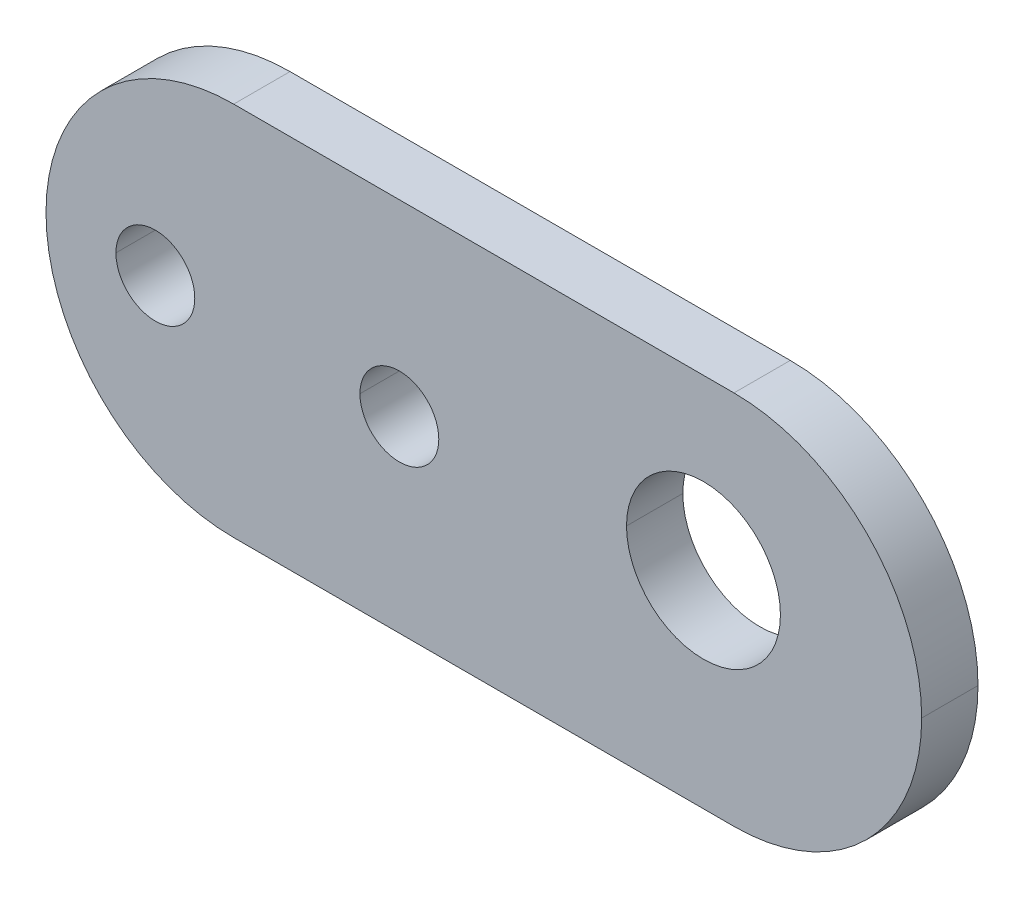
ISO-10303-21;
HEADER;
FILE_DESCRIPTION(('STEP AP214'),'2;1');
FILE_NAME('part.step','',(''),(''),'','','');
FILE_SCHEMA(('AUTOMOTIVE_DESIGN { 1 0 10303 214 1 1 1 1 }'));
ENDSEC;
DATA;
#1=APPLICATION_CONTEXT('core data for automotive mechanical design processes');
#2=APPLICATION_PROTOCOL_DEFINITION('international standard','automotive_design',2000,#1);
#3=PRODUCT_CONTEXT('',#1,'mechanical');
#4=PRODUCT('Part','Part','',(#3));
#5=PRODUCT_RELATED_PRODUCT_CATEGORY('part','',(#4));
#6=PRODUCT_DEFINITION_FORMATION('','',#4);
#7=PRODUCT_DEFINITION_CONTEXT('part definition',#1,'design');
#8=PRODUCT_DEFINITION('design','',#6,#7);
#9=PRODUCT_DEFINITION_SHAPE('','',#8);
#10=(LENGTH_UNIT() NAMED_UNIT(*) SI_UNIT(.MILLI.,.METRE.));
#11=(NAMED_UNIT(*) PLANE_ANGLE_UNIT() SI_UNIT($,.RADIAN.));
#12=(NAMED_UNIT(*) SI_UNIT($,.STERADIAN.) SOLID_ANGLE_UNIT());
#13=UNCERTAINTY_MEASURE_WITH_UNIT(LENGTH_MEASURE(1.E-05),#10,'distance_accuracy_value','');
#14=(GEOMETRIC_REPRESENTATION_CONTEXT(3) GLOBAL_UNCERTAINTY_ASSIGNED_CONTEXT((#13)) GLOBAL_UNIT_ASSIGNED_CONTEXT((#10,
#11,#12)) REPRESENTATION_CONTEXT('',''));
#15=CARTESIAN_POINT('',(0.,0.,0.));
#16=DIRECTION('',(0.,0.,1.));
#17=DIRECTION('',(1.,0.,0.));
#18=AXIS2_PLACEMENT_3D('',#15,#16,#17);
#19=CARTESIAN_POINT('',(-13.325,0.,-3.));
#20=DIRECTION('',(0.,0.,1.));
#21=DIRECTION('',(1.,0.,0.));
#22=AXIS2_PLACEMENT_3D('',#19,#20,#21);
#23=CYLINDRICAL_SURFACE('',#22,10.);
#24=CARTESIAN_POINT('',(-13.325,0.,-3.));
#25=DIRECTION('',(0.,0.,-1.));
#26=DIRECTION('',(-1.,0.,0.));
#27=AXIS2_PLACEMENT_3D('',#24,#25,#26);
#28=CIRCLE('',#27,10.);
#29=CARTESIAN_POINT('',(-13.325,-10.,-3.));
#30=VERTEX_POINT('',#29);
#31=CARTESIAN_POINT('',(-23.325,0.,-3.));
#32=VERTEX_POINT('',#31);
#33=EDGE_CURVE('E197',#30,#32,#28,.T.);
#34=ORIENTED_EDGE('',*,*,#33,.F.);
#35=DIRECTION('',(0.,0.,-1.));
#36=VECTOR('',#35,1.);
#37=CARTESIAN_POINT('',(-13.325,-10.,-3.));
#38=LINE('',#37,#36);
#39=CARTESIAN_POINT('',(-13.325,-10.,0.));
#40=VERTEX_POINT('',#39);
#41=EDGE_CURVE('E202',#40,#30,#38,.T.);
#42=ORIENTED_EDGE('',*,*,#41,.F.);
#43=CARTESIAN_POINT('',(-13.325,0.,0.));
#44=DIRECTION('',(0.,0.,1.));
#45=DIRECTION('',(-1.,0.,0.));
#46=AXIS2_PLACEMENT_3D('',#43,#44,#45);
#47=CIRCLE('',#46,10.);
#48=CARTESIAN_POINT('',(-23.325,0.,0.));
#49=VERTEX_POINT('',#48);
#50=EDGE_CURVE('E256',#49,#40,#47,.T.);
#51=ORIENTED_EDGE('',*,*,#50,.F.);
#52=DIRECTION('',(0.,0.,-1.));
#53=VECTOR('',#52,1.);
#54=CARTESIAN_POINT('',(-23.325,0.,-3.));
#55=LINE('',#54,#53);
#56=EDGE_CURVE('E11',#49,#32,#55,.T.);
#57=ORIENTED_EDGE('',*,*,#56,.T.);
#58=EDGE_LOOP('',(#34,#42,#51,#57));
#59=FACE_BOUND('',#58,.T.);
#60=ADVANCED_FACE('F17',(#59),#23,.T.);
#61=CARTESIAN_POINT('',(-13.325,0.,-3.));
#62=DIRECTION('',(0.,0.,1.));
#63=DIRECTION('',(1.,0.,0.));
#64=AXIS2_PLACEMENT_3D('',#61,#62,#63);
#65=CYLINDRICAL_SURFACE('',#64,10.);
#66=DIRECTION('',(0.,0.,1.));
#67=VECTOR('',#66,1.);
#68=CARTESIAN_POINT('',(-13.325,10.,-3.));
#69=LINE('',#68,#67);
#70=CARTESIAN_POINT('',(-13.325,10.,-3.));
#71=VERTEX_POINT('',#70);
#72=CARTESIAN_POINT('',(-13.325,10.,0.));
#73=VERTEX_POINT('',#72);
#74=EDGE_CURVE('E181',#71,#73,#69,.T.);
#75=ORIENTED_EDGE('',*,*,#74,.F.);
#76=CARTESIAN_POINT('',(-13.325,0.,-3.));
#77=DIRECTION('',(0.,0.,-1.));
#78=DIRECTION('',(-1.,0.,0.));
#79=AXIS2_PLACEMENT_3D('',#76,#77,#78);
#80=CIRCLE('',#79,10.);
#81=EDGE_CURVE('E201',#32,#71,#80,.T.);
#82=ORIENTED_EDGE('',*,*,#81,.F.);
#83=ORIENTED_EDGE('',*,*,#56,.F.);
#84=CARTESIAN_POINT('',(-13.325,0.,0.));
#85=DIRECTION('',(0.,0.,1.));
#86=DIRECTION('',(-1.,0.,0.));
#87=AXIS2_PLACEMENT_3D('',#84,#85,#86);
#88=CIRCLE('',#87,10.);
#89=EDGE_CURVE('E252',#73,#49,#88,.T.);
#90=ORIENTED_EDGE('',*,*,#89,.F.);
#91=EDGE_LOOP('',(#75,#82,#83,#90));
#92=FACE_BOUND('',#91,.T.);
#93=ADVANCED_FACE('F19',(#92),#65,.T.);
#94=CARTESIAN_POINT('',(13.325,0.,-3.));
#95=DIRECTION('',(0.,0.,1.));
#96=DIRECTION('',(1.,0.,0.));
#97=AXIS2_PLACEMENT_3D('',#94,#95,#96);
#98=CYLINDRICAL_SURFACE('',#97,10.);
#99=CARTESIAN_POINT('',(13.325,0.,-3.));
#100=DIRECTION('',(0.,0.,-1.));
#101=DIRECTION('',(-1.,0.,0.));
#102=AXIS2_PLACEMENT_3D('',#99,#100,#101);
#103=CIRCLE('',#102,10.);
#104=CARTESIAN_POINT('',(23.325,0.,-3.));
#105=VERTEX_POINT('',#104);
#106=CARTESIAN_POINT('',(13.325,-10.,-3.));
#107=VERTEX_POINT('',#106);
#108=EDGE_CURVE('E241',#105,#107,#103,.T.);
#109=ORIENTED_EDGE('',*,*,#108,.F.);
#110=DIRECTION('',(0.,0.,1.));
#111=VECTOR('',#110,1.);
#112=CARTESIAN_POINT('',(23.325,0.,-3.));
#113=LINE('',#112,#111);
#114=CARTESIAN_POINT('',(23.325,0.,0.));
#115=VERTEX_POINT('',#114);
#116=EDGE_CURVE('E26',#105,#115,#113,.T.);
#117=ORIENTED_EDGE('',*,*,#116,.T.);
#118=CARTESIAN_POINT('',(13.325,0.,0.));
#119=DIRECTION('',(0.,0.,1.));
#120=DIRECTION('',(-1.,0.,0.));
#121=AXIS2_PLACEMENT_3D('',#118,#119,#120);
#122=CIRCLE('',#121,10.);
#123=CARTESIAN_POINT('',(13.325,-10.,0.));
#124=VERTEX_POINT('',#123);
#125=EDGE_CURVE('E259',#124,#115,#122,.T.);
#126=ORIENTED_EDGE('',*,*,#125,.F.);
#127=DIRECTION('',(0.,0.,1.));
#128=VECTOR('',#127,1.);
#129=CARTESIAN_POINT('',(13.325,-10.,-3.));
#130=LINE('',#129,#128);
#131=EDGE_CURVE('E224',#107,#124,#130,.T.);
#132=ORIENTED_EDGE('',*,*,#131,.F.);
#133=EDGE_LOOP('',(#109,#117,#126,#132));
#134=FACE_BOUND('',#133,.T.);
#135=ADVANCED_FACE('F441',(#134),#98,.T.);
#136=CARTESIAN_POINT('',(13.325,0.,-3.));
#137=DIRECTION('',(0.,0.,1.));
#138=DIRECTION('',(1.,0.,0.));
#139=AXIS2_PLACEMENT_3D('',#136,#137,#138);
#140=CYLINDRICAL_SURFACE('',#139,10.);
#141=ORIENTED_EDGE('',*,*,#116,.F.);
#142=CARTESIAN_POINT('',(13.325,0.,-3.));
#143=DIRECTION('',(0.,0.,-1.));
#144=DIRECTION('',(-1.,0.,0.));
#145=AXIS2_PLACEMENT_3D('',#142,#143,#144);
#146=CIRCLE('',#145,10.);
#147=CARTESIAN_POINT('',(13.325,10.,-3.));
#148=VERTEX_POINT('',#147);
#149=EDGE_CURVE('E237',#148,#105,#146,.T.);
#150=ORIENTED_EDGE('',*,*,#149,.F.);
#151=DIRECTION('',(0.,0.,-1.));
#152=VECTOR('',#151,1.);
#153=CARTESIAN_POINT('',(13.325,10.,-3.));
#154=LINE('',#153,#152);
#155=CARTESIAN_POINT('',(13.325,10.,0.));
#156=VERTEX_POINT('',#155);
#157=EDGE_CURVE('E216',#156,#148,#154,.T.);
#158=ORIENTED_EDGE('',*,*,#157,.F.);
#159=CARTESIAN_POINT('',(13.325,0.,0.));
#160=DIRECTION('',(0.,0.,1.));
#161=DIRECTION('',(-1.,0.,0.));
#162=AXIS2_PLACEMENT_3D('',#159,#160,#161);
#163=CIRCLE('',#162,10.);
#164=EDGE_CURVE('E209',#115,#156,#163,.T.);
#165=ORIENTED_EDGE('',*,*,#164,.F.);
#166=EDGE_LOOP('',(#141,#150,#158,#165));
#167=FACE_BOUND('',#166,.T.);
#168=ADVANCED_FACE('F443',(#167),#140,.T.);
#169=CARTESIAN_POINT('',(11.7,1.,-3.));
#170=DIRECTION('',(0.,0.,1.));
#171=DIRECTION('',(1.,0.,0.));
#172=AXIS2_PLACEMENT_3D('',#169,#170,#171);
#173=CYLINDRICAL_SURFACE('',#172,4.1);
#174=DIRECTION('',(0.,0.,1.));
#175=VECTOR('',#174,1.);
#176=CARTESIAN_POINT('',(7.6,1.,-3.));
#177=LINE('',#176,#175);
#178=CARTESIAN_POINT('',(7.6,1.,-3.));
#179=VERTEX_POINT('',#178);
#180=CARTESIAN_POINT('',(7.6,1.,0.));
#181=VERTEX_POINT('',#180);
#182=EDGE_CURVE('E170',#179,#181,#177,.T.);
#183=ORIENTED_EDGE('',*,*,#182,.F.);
#184=CARTESIAN_POINT('',(11.7,1.,-3.));
#185=DIRECTION('',(0.,0.,1.));
#186=DIRECTION('',(1.,0.,0.));
#187=AXIS2_PLACEMENT_3D('',#184,#185,#186);
#188=CIRCLE('',#187,4.1);
#189=CARTESIAN_POINT('',(15.8,1.,-3.));
#190=VERTEX_POINT('',#189);
#191=EDGE_CURVE('E244',#190,#179,#188,.T.);
#192=ORIENTED_EDGE('',*,*,#191,.F.);
#193=DIRECTION('',(0.,0.,1.));
#194=VECTOR('',#193,1.);
#195=CARTESIAN_POINT('',(15.8,1.,-3.));
#196=LINE('',#195,#194);
#197=CARTESIAN_POINT('',(15.8,1.,0.));
#198=VERTEX_POINT('',#197);
#199=EDGE_CURVE('E175',#190,#198,#196,.T.);
#200=ORIENTED_EDGE('',*,*,#199,.T.);
#201=CARTESIAN_POINT('',(11.7,1.,0.));
#202=DIRECTION('',(0.,0.,1.));
#203=DIRECTION('',(1.,0.,0.));
#204=AXIS2_PLACEMENT_3D('',#201,#202,#203);
#205=CIRCLE('',#204,4.1);
#206=EDGE_CURVE('E206',#198,#181,#205,.T.);
#207=ORIENTED_EDGE('',*,*,#206,.T.);
#208=EDGE_LOOP('',(#183,#192,#200,#207));
#209=FACE_BOUND('',#208,.T.);
#210=ADVANCED_FACE('F423',(#209),#173,.F.);
#211=CARTESIAN_POINT('',(-4.5,0.,-3.));
#212=DIRECTION('',(0.,0.,1.));
#213=DIRECTION('',(1.,0.,0.));
#214=AXIS2_PLACEMENT_3D('',#211,#212,#213);
#215=CYLINDRICAL_SURFACE('',#214,2.1);
#216=DIRECTION('',(0.,0.,1.));
#217=VECTOR('',#216,1.);
#218=CARTESIAN_POINT('',(-6.6,0.,-3.));
#219=LINE('',#218,#217);
#220=CARTESIAN_POINT('',(-6.6,0.,-3.));
#221=VERTEX_POINT('',#220);
#222=CARTESIAN_POINT('',(-6.6,0.,0.));
#223=VERTEX_POINT('',#222);
#224=EDGE_CURVE('E189',#221,#223,#219,.T.);
#225=ORIENTED_EDGE('',*,*,#224,.F.);
#226=CARTESIAN_POINT('',(-4.5,0.,-3.));
#227=DIRECTION('',(0.,0.,1.));
#228=DIRECTION('',(1.,0.,0.));
#229=AXIS2_PLACEMENT_3D('',#226,#227,#228);
#230=CIRCLE('',#229,2.1);
#231=CARTESIAN_POINT('',(-2.4,0.,-3.));
#232=VERTEX_POINT('',#231);
#233=EDGE_CURVE('E247',#232,#221,#230,.T.);
#234=ORIENTED_EDGE('',*,*,#233,.F.);
#235=DIRECTION('',(0.,0.,1.));
#236=VECTOR('',#235,1.);
#237=CARTESIAN_POINT('',(-2.4,0.,-3.));
#238=LINE('',#237,#236);
#239=CARTESIAN_POINT('',(-2.4,0.,0.));
#240=VERTEX_POINT('',#239);
#241=EDGE_CURVE('E205',#232,#240,#238,.T.);
#242=ORIENTED_EDGE('',*,*,#241,.T.);
#243=CARTESIAN_POINT('',(-4.5,0.,0.));
#244=DIRECTION('',(0.,0.,1.));
#245=DIRECTION('',(1.,0.,0.));
#246=AXIS2_PLACEMENT_3D('',#243,#244,#245);
#247=CIRCLE('',#246,2.1);
#248=EDGE_CURVE('E146',#240,#223,#247,.T.);
#249=ORIENTED_EDGE('',*,*,#248,.T.);
#250=EDGE_LOOP('',(#225,#234,#242,#249));
#251=FACE_BOUND('',#250,.T.);
#252=ADVANCED_FACE('F459',(#251),#215,.F.);
#253=CARTESIAN_POINT('',(-17.5,0.,-3.));
#254=DIRECTION('',(0.,0.,1.));
#255=DIRECTION('',(1.,0.,0.));
#256=AXIS2_PLACEMENT_3D('',#253,#254,#255);
#257=CYLINDRICAL_SURFACE('',#256,2.1);
#258=DIRECTION('',(0.,0.,1.));
#259=VECTOR('',#258,1.);
#260=CARTESIAN_POINT('',(-19.6,0.,-3.));
#261=LINE('',#260,#259);
#262=CARTESIAN_POINT('',(-19.6,0.,-3.));
#263=VERTEX_POINT('',#262);
#264=CARTESIAN_POINT('',(-19.6,0.,0.));
#265=VERTEX_POINT('',#264);
#266=EDGE_CURVE('E159',#263,#265,#261,.T.);
#267=ORIENTED_EDGE('',*,*,#266,.F.);
#268=CARTESIAN_POINT('',(-17.5,0.,-3.));
#269=DIRECTION('',(0.,0.,1.));
#270=DIRECTION('',(1.,0.,0.));
#271=AXIS2_PLACEMENT_3D('',#268,#269,#270);
#272=CIRCLE('',#271,2.1);
#273=CARTESIAN_POINT('',(-15.4,0.,-3.));
#274=VERTEX_POINT('',#273);
#275=EDGE_CURVE('E151',#274,#263,#272,.T.);
#276=ORIENTED_EDGE('',*,*,#275,.F.);
#277=DIRECTION('',(0.,0.,1.));
#278=VECTOR('',#277,1.);
#279=CARTESIAN_POINT('',(-15.4,0.,-3.));
#280=LINE('',#279,#278);
#281=CARTESIAN_POINT('',(-15.4,0.,0.));
#282=VERTEX_POINT('',#281);
#283=EDGE_CURVE('E149',#274,#282,#280,.T.);
#284=ORIENTED_EDGE('',*,*,#283,.T.);
#285=CARTESIAN_POINT('',(-17.5,0.,0.));
#286=DIRECTION('',(0.,0.,1.));
#287=DIRECTION('',(1.,0.,0.));
#288=AXIS2_PLACEMENT_3D('',#285,#286,#287);
#289=CIRCLE('',#288,2.1);
#290=EDGE_CURVE('E136',#282,#265,#289,.T.);
#291=ORIENTED_EDGE('',*,*,#290,.T.);
#292=EDGE_LOOP('',(#267,#276,#284,#291));
#293=FACE_BOUND('',#292,.T.);
#294=ADVANCED_FACE('F150',(#293),#257,.F.);
#295=CARTESIAN_POINT('',(0.,0.,0.));
#296=DIRECTION('',(0.,0.,-1.));
#297=DIRECTION('',(0.,-1.,0.));
#298=AXIS2_PLACEMENT_3D('',#295,#296,#297);
#299=PLANE('',#298);
#300=ORIENTED_EDGE('',*,*,#290,.F.);
#301=CARTESIAN_POINT('',(-17.5,0.,0.));
#302=DIRECTION('',(0.,0.,1.));
#303=DIRECTION('',(1.,0.,0.));
#304=AXIS2_PLACEMENT_3D('',#301,#302,#303);
#305=CIRCLE('',#304,2.1);
#306=EDGE_CURVE('E141',#265,#282,#305,.T.);
#307=ORIENTED_EDGE('',*,*,#306,.F.);
#308=EDGE_LOOP('',(#300,#307));
#309=FACE_BOUND('',#308,.T.);
#310=ORIENTED_EDGE('',*,*,#248,.F.);
#311=CARTESIAN_POINT('',(-4.5,0.,0.));
#312=DIRECTION('',(0.,0.,1.));
#313=DIRECTION('',(1.,0.,0.));
#314=AXIS2_PLACEMENT_3D('',#311,#312,#313);
#315=CIRCLE('',#314,2.1);
#316=EDGE_CURVE('E193',#223,#240,#315,.T.);
#317=ORIENTED_EDGE('',*,*,#316,.F.);
#318=EDGE_LOOP('',(#310,#317));
#319=FACE_BOUND('',#318,.T.);
#320=ORIENTED_EDGE('',*,*,#206,.F.);
#321=CARTESIAN_POINT('',(11.7,1.,0.));
#322=DIRECTION('',(0.,0.,1.));
#323=DIRECTION('',(1.,0.,0.));
#324=AXIS2_PLACEMENT_3D('',#321,#322,#323);
#325=CIRCLE('',#324,4.1);
#326=EDGE_CURVE('E172',#181,#198,#325,.T.);
#327=ORIENTED_EDGE('',*,*,#326,.F.);
#328=EDGE_LOOP('',(#320,#327));
#329=FACE_BOUND('',#328,.T.);
#330=ORIENTED_EDGE('',*,*,#89,.T.);
#331=ORIENTED_EDGE('',*,*,#50,.T.);
#332=DIRECTION('',(1.,0.,0.));
#333=VECTOR('',#332,1.);
#334=CARTESIAN_POINT('',(23.325,-10.,0.));
#335=LINE('',#334,#333);
#336=EDGE_CURVE('E228',#40,#124,#335,.T.);
#337=ORIENTED_EDGE('',*,*,#336,.T.);
#338=ORIENTED_EDGE('',*,*,#125,.T.);
#339=ORIENTED_EDGE('',*,*,#164,.T.);
#340=DIRECTION('',(-1.,0.,0.));
#341=VECTOR('',#340,1.);
#342=CARTESIAN_POINT('',(23.325,10.,0.));
#343=LINE('',#342,#341);
#344=EDGE_CURVE('E185',#156,#73,#343,.T.);
#345=ORIENTED_EDGE('',*,*,#344,.T.);
#346=EDGE_LOOP('',(#330,#331,#337,#338,#339,#345));
#347=FACE_BOUND('',#346,.T.);
#348=ADVANCED_FACE('F138',(#309,#319,#329,#347),#299,.F.);
#349=CARTESIAN_POINT('',(0.,0.,-3.));
#350=DIRECTION('',(0.,0.,-1.));
#351=DIRECTION('',(0.,-1.,0.));
#352=AXIS2_PLACEMENT_3D('',#349,#350,#351);
#353=PLANE('',#352);
#354=ORIENTED_EDGE('',*,*,#275,.T.);
#355=CARTESIAN_POINT('',(-17.5,0.,-3.));
#356=DIRECTION('',(0.,0.,1.));
#357=DIRECTION('',(1.,0.,0.));
#358=AXIS2_PLACEMENT_3D('',#355,#356,#357);
#359=CIRCLE('',#358,2.1);
#360=EDGE_CURVE('E166',#263,#274,#359,.T.);
#361=ORIENTED_EDGE('',*,*,#360,.T.);
#362=EDGE_LOOP('',(#354,#361));
#363=FACE_BOUND('',#362,.T.);
#364=ORIENTED_EDGE('',*,*,#233,.T.);
#365=CARTESIAN_POINT('',(-4.5,0.,-3.));
#366=DIRECTION('',(0.,0.,1.));
#367=DIRECTION('',(1.,0.,0.));
#368=AXIS2_PLACEMENT_3D('',#365,#366,#367);
#369=CIRCLE('',#368,2.1);
#370=EDGE_CURVE('E180',#221,#232,#369,.T.);
#371=ORIENTED_EDGE('',*,*,#370,.T.);
#372=EDGE_LOOP('',(#364,#371));
#373=FACE_BOUND('',#372,.T.);
#374=ORIENTED_EDGE('',*,*,#191,.T.);
#375=CARTESIAN_POINT('',(11.7,1.,-3.));
#376=DIRECTION('',(0.,0.,1.));
#377=DIRECTION('',(1.,0.,0.));
#378=AXIS2_PLACEMENT_3D('',#375,#376,#377);
#379=CIRCLE('',#378,4.1);
#380=EDGE_CURVE('E395',#179,#190,#379,.T.);
#381=ORIENTED_EDGE('',*,*,#380,.T.);
#382=EDGE_LOOP('',(#374,#381));
#383=FACE_BOUND('',#382,.T.);
#384=DIRECTION('',(1.,0.,0.));
#385=VECTOR('',#384,1.);
#386=CARTESIAN_POINT('',(23.325,-10.,-3.));
#387=LINE('',#386,#385);
#388=EDGE_CURVE('E220',#30,#107,#387,.T.);
#389=ORIENTED_EDGE('',*,*,#388,.F.);
#390=ORIENTED_EDGE('',*,*,#33,.T.);
#391=ORIENTED_EDGE('',*,*,#81,.T.);
#392=DIRECTION('',(-1.,0.,0.));
#393=VECTOR('',#392,1.);
#394=CARTESIAN_POINT('',(23.325,10.,-3.));
#395=LINE('',#394,#393);
#396=EDGE_CURVE('E156',#148,#71,#395,.T.);
#397=ORIENTED_EDGE('',*,*,#396,.F.);
#398=ORIENTED_EDGE('',*,*,#149,.T.);
#399=ORIENTED_EDGE('',*,*,#108,.T.);
#400=EDGE_LOOP('',(#389,#390,#391,#397,#398,#399));
#401=FACE_BOUND('',#400,.T.);
#402=ADVANCED_FACE('F415',(#363,#373,#383,#401),#353,.T.);
#403=CARTESIAN_POINT('',(23.325,-10.,-3.));
#404=DIRECTION('',(0.,-1.,0.));
#405=DIRECTION('',(0.,0.,-1.));
#406=AXIS2_PLACEMENT_3D('',#403,#404,#405);
#407=PLANE('',#406);
#408=ORIENTED_EDGE('',*,*,#388,.T.);
#409=ORIENTED_EDGE('',*,*,#131,.T.);
#410=ORIENTED_EDGE('',*,*,#336,.F.);
#411=ORIENTED_EDGE('',*,*,#41,.T.);
#412=EDGE_LOOP('',(#408,#409,#410,#411));
#413=FACE_BOUND('',#412,.T.);
#414=ADVANCED_FACE('F439',(#413),#407,.T.);
#415=CARTESIAN_POINT('',(23.325,10.,-3.));
#416=DIRECTION('',(0.,1.,0.));
#417=DIRECTION('',(1.,0.,0.));
#418=AXIS2_PLACEMENT_3D('',#415,#416,#417);
#419=PLANE('',#418);
#420=ORIENTED_EDGE('',*,*,#396,.T.);
#421=ORIENTED_EDGE('',*,*,#74,.T.);
#422=ORIENTED_EDGE('',*,*,#344,.F.);
#423=ORIENTED_EDGE('',*,*,#157,.T.);
#424=EDGE_LOOP('',(#420,#421,#422,#423));
#425=FACE_BOUND('',#424,.T.);
#426=ADVANCED_FACE('F433',(#425),#419,.T.);
#427=CARTESIAN_POINT('',(-17.5,0.,-3.));
#428=DIRECTION('',(0.,0.,1.));
#429=DIRECTION('',(1.,0.,0.));
#430=AXIS2_PLACEMENT_3D('',#427,#428,#429);
#431=CYLINDRICAL_SURFACE('',#430,2.1);
#432=ORIENTED_EDGE('',*,*,#360,.F.);
#433=ORIENTED_EDGE('',*,*,#266,.T.);
#434=ORIENTED_EDGE('',*,*,#306,.T.);
#435=ORIENTED_EDGE('',*,*,#283,.F.);
#436=EDGE_LOOP('',(#432,#433,#434,#435));
#437=FACE_BOUND('',#436,.T.);
#438=ADVANCED_FACE('F158',(#437),#431,.F.);
#439=CARTESIAN_POINT('',(-4.5,0.,-3.));
#440=DIRECTION('',(0.,0.,1.));
#441=DIRECTION('',(1.,0.,0.));
#442=AXIS2_PLACEMENT_3D('',#439,#440,#441);
#443=CYLINDRICAL_SURFACE('',#442,2.1);
#444=ORIENTED_EDGE('',*,*,#370,.F.);
#445=ORIENTED_EDGE('',*,*,#224,.T.);
#446=ORIENTED_EDGE('',*,*,#316,.T.);
#447=ORIENTED_EDGE('',*,*,#241,.F.);
#448=EDGE_LOOP('',(#444,#445,#446,#447));
#449=FACE_BOUND('',#448,.T.);
#450=ADVANCED_FACE('F465',(#449),#443,.F.);
#451=CARTESIAN_POINT('',(11.7,1.,-3.));
#452=DIRECTION('',(0.,0.,1.));
#453=DIRECTION('',(1.,0.,0.));
#454=AXIS2_PLACEMENT_3D('',#451,#452,#453);
#455=CYLINDRICAL_SURFACE('',#454,4.1);
#456=ORIENTED_EDGE('',*,*,#380,.F.);
#457=ORIENTED_EDGE('',*,*,#182,.T.);
#458=ORIENTED_EDGE('',*,*,#326,.T.);
#459=ORIENTED_EDGE('',*,*,#199,.F.);
#460=EDGE_LOOP('',(#456,#457,#458,#459));
#461=FACE_BOUND('',#460,.T.);
#462=ADVANCED_FACE('F420',(#461),#455,.F.);
#463=CLOSED_SHELL('',(#60,#93,#135,#168,#210,#252,#294,#348,#402,#414,#426,#438,#450,#462));
#464=MANIFOLD_SOLID_BREP('B1',#463);
#465=ADVANCED_BREP_SHAPE_REPRESENTATION('',(#18,#464),#14);
#466=SHAPE_DEFINITION_REPRESENTATION(#9,#465);
ENDSEC;
END-ISO-10303-21;
